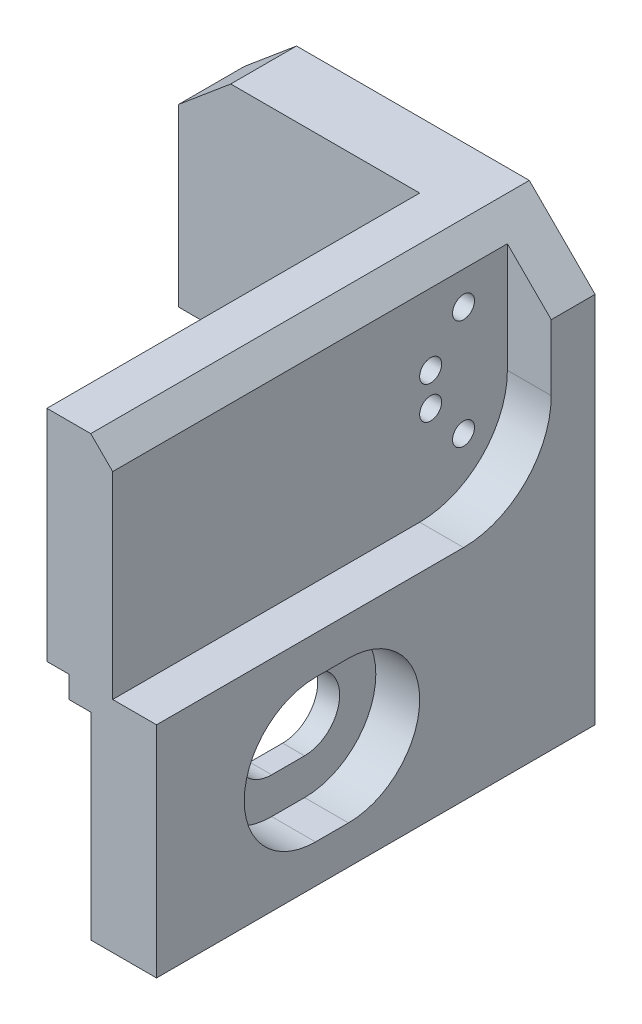
ISO-10303-21;
HEADER;
FILE_DESCRIPTION(('STEP AP214'),'2;1');
FILE_NAME('part.step','',(''),(''),'','','');
FILE_SCHEMA(('AUTOMOTIVE_DESIGN { 1 0 10303 214 1 1 1 1 }'));
ENDSEC;
DATA;
#1=APPLICATION_CONTEXT('core data for automotive mechanical design processes');
#2=APPLICATION_PROTOCOL_DEFINITION('international standard','automotive_design',2000,#1);
#3=PRODUCT_CONTEXT('',#1,'mechanical');
#4=PRODUCT('Part','Part','',(#3));
#5=PRODUCT_RELATED_PRODUCT_CATEGORY('part','',(#4));
#6=PRODUCT_DEFINITION_FORMATION('','',#4);
#7=PRODUCT_DEFINITION_CONTEXT('part definition',#1,'design');
#8=PRODUCT_DEFINITION('design','',#6,#7);
#9=PRODUCT_DEFINITION_SHAPE('','',#8);
#10=(LENGTH_UNIT() NAMED_UNIT(*) SI_UNIT(.MILLI.,.METRE.));
#11=(NAMED_UNIT(*) PLANE_ANGLE_UNIT() SI_UNIT($,.RADIAN.));
#12=(NAMED_UNIT(*) SI_UNIT($,.STERADIAN.) SOLID_ANGLE_UNIT());
#13=UNCERTAINTY_MEASURE_WITH_UNIT(LENGTH_MEASURE(1.E-05),#10,'distance_accuracy_value','');
#14=(GEOMETRIC_REPRESENTATION_CONTEXT(3) GLOBAL_UNCERTAINTY_ASSIGNED_CONTEXT((#13)) GLOBAL_UNIT_ASSIGNED_CONTEXT((#10,
#11,#12)) REPRESENTATION_CONTEXT('',''));
#15=CARTESIAN_POINT('',(0.,0.,0.));
#16=DIRECTION('',(0.,0.,1.));
#17=DIRECTION('',(1.,0.,0.));
#18=AXIS2_PLACEMENT_3D('',#15,#16,#17);
#19=CARTESIAN_POINT('',(-12.001,-5.6,-12.1414213562373));
#20=DIRECTION('',(0.,-1.,0.));
#21=DIRECTION('',(0.,0.,-1.));
#22=AXIS2_PLACEMENT_3D('',#19,#20,#21);
#23=PLANE('',#22);
#24=DIRECTION('',(0.,0.,-1.));
#25=VECTOR('',#24,1.);
#26=CARTESIAN_POINT('',(2.,-5.6,12.75));
#27=LINE('',#26,#25);
#28=CARTESIAN_POINT('',(2.,-5.6,12.75));
#29=VERTEX_POINT('',#28);
#30=CARTESIAN_POINT('',(2.,-5.6,11.25));
#31=VERTEX_POINT('',#30);
#32=EDGE_CURVE('E233',#29,#31,#27,.T.);
#33=ORIENTED_EDGE('',*,*,#32,.T.);
#34=DIRECTION('',(1.,0.,0.));
#35=VECTOR('',#34,1.);
#36=CARTESIAN_POINT('',(-12.001,-5.6,11.25));
#37=LINE('',#36,#35);
#38=CARTESIAN_POINT('',(1.,-5.6,11.25));
#39=VERTEX_POINT('',#38);
#40=EDGE_CURVE('E281',#39,#31,#37,.T.);
#41=ORIENTED_EDGE('',*,*,#40,.F.);
#42=DIRECTION('',(0.,0.,1.));
#43=VECTOR('',#42,1.);
#44=CARTESIAN_POINT('',(1.,-5.6,-12.1414213562373));
#45=LINE('',#44,#43);
#46=CARTESIAN_POINT('',(1.,-5.6,12.75));
#47=VERTEX_POINT('',#46);
#48=EDGE_CURVE('E278',#39,#47,#45,.T.);
#49=ORIENTED_EDGE('',*,*,#48,.T.);
#50=DIRECTION('',(1.,0.,0.));
#51=VECTOR('',#50,1.);
#52=CARTESIAN_POINT('',(-12.001,-5.6,12.75));
#53=LINE('',#52,#51);
#54=EDGE_CURVE('E282',#47,#29,#53,.T.);
#55=ORIENTED_EDGE('',*,*,#54,.T.);
#56=EDGE_LOOP('',(#33,#41,#49,#55));
#57=FACE_BOUND('',#56,.T.);
#58=ADVANCED_FACE('F39',(#57),#23,.F.);
#59=CARTESIAN_POINT('',(-12.001,-4.,12.75));
#60=DIRECTION('',(1.,0.,0.));
#61=DIRECTION('',(0.,0.,-1.));
#62=AXIS2_PLACEMENT_3D('',#59,#60,#61);
#63=CYLINDRICAL_SURFACE('',#62,1.6);
#64=CARTESIAN_POINT('',(2.,-4.,12.75));
#65=DIRECTION('',(1.,0.,0.));
#66=DIRECTION('',(0.,0.,-1.));
#67=AXIS2_PLACEMENT_3D('',#64,#65,#66);
#68=CIRCLE('',#67,1.6);
#69=CARTESIAN_POINT('',(2.,-2.4,12.75));
#70=VERTEX_POINT('',#69);
#71=EDGE_CURVE('E230',#70,#29,#68,.T.);
#72=ORIENTED_EDGE('',*,*,#71,.T.);
#73=ORIENTED_EDGE('',*,*,#54,.F.);
#74=CARTESIAN_POINT('',(1.,-4.,12.75));
#75=DIRECTION('',(1.,0.,0.));
#76=DIRECTION('',(0.,1.,0.));
#77=AXIS2_PLACEMENT_3D('',#74,#75,#76);
#78=CIRCLE('',#77,1.6);
#79=CARTESIAN_POINT('',(1.,-2.4,12.75));
#80=VERTEX_POINT('',#79);
#81=EDGE_CURVE('E275',#47,#80,#78,.F.);
#82=ORIENTED_EDGE('',*,*,#81,.T.);
#83=DIRECTION('',(1.,0.,0.));
#84=VECTOR('',#83,1.);
#85=CARTESIAN_POINT('',(-12.001,-2.4,12.75));
#86=LINE('',#85,#84);
#87=EDGE_CURVE('E286',#80,#70,#86,.T.);
#88=ORIENTED_EDGE('',*,*,#87,.T.);
#89=EDGE_LOOP('',(#72,#73,#82,#88));
#90=FACE_BOUND('',#89,.T.);
#91=ADVANCED_FACE('F485',(#90),#63,.F.);
#92=CARTESIAN_POINT('',(-12.001,-2.39999999999999,-12.1414213562373));
#93=DIRECTION('',(0.,-1.,0.));
#94=DIRECTION('',(0.,0.,-1.));
#95=AXIS2_PLACEMENT_3D('',#92,#93,#94);
#96=PLANE('',#95);
#97=DIRECTION('',(1.,0.,0.));
#98=VECTOR('',#97,1.);
#99=CARTESIAN_POINT('',(-12.001,-2.4,11.25));
#100=LINE('',#99,#98);
#101=CARTESIAN_POINT('',(1.,-2.4,11.25));
#102=VERTEX_POINT('',#101);
#103=CARTESIAN_POINT('',(2.,-2.4,11.25));
#104=VERTEX_POINT('',#103);
#105=EDGE_CURVE('E289',#102,#104,#100,.T.);
#106=ORIENTED_EDGE('',*,*,#105,.T.);
#107=DIRECTION('',(0.,0.,1.));
#108=VECTOR('',#107,1.);
#109=CARTESIAN_POINT('',(2.,-2.4,12.75));
#110=LINE('',#109,#108);
#111=EDGE_CURVE('E239',#104,#70,#110,.T.);
#112=ORIENTED_EDGE('',*,*,#111,.T.);
#113=ORIENTED_EDGE('',*,*,#87,.F.);
#114=DIRECTION('',(0.,0.,1.));
#115=VECTOR('',#114,1.);
#116=CARTESIAN_POINT('',(1.,-2.39999999999999,-12.1414213562373));
#117=LINE('',#116,#115);
#118=EDGE_CURVE('E267',#102,#80,#117,.T.);
#119=ORIENTED_EDGE('',*,*,#118,.F.);
#120=EDGE_LOOP('',(#106,#112,#113,#119));
#121=FACE_BOUND('',#120,.T.);
#122=ADVANCED_FACE('F491',(#121),#96,.T.);
#123=CARTESIAN_POINT('',(-12.001,-4.,11.25));
#124=DIRECTION('',(1.,0.,0.));
#125=DIRECTION('',(0.,0.,-1.));
#126=AXIS2_PLACEMENT_3D('',#123,#124,#125);
#127=CYLINDRICAL_SURFACE('',#126,1.6);
#128=CARTESIAN_POINT('',(2.,-4.,11.25));
#129=DIRECTION('',(1.,0.,0.));
#130=DIRECTION('',(0.,0.,-1.));
#131=AXIS2_PLACEMENT_3D('',#128,#129,#130);
#132=CIRCLE('',#131,1.6);
#133=EDGE_CURVE('E236',#31,#104,#132,.T.);
#134=ORIENTED_EDGE('',*,*,#133,.T.);
#135=ORIENTED_EDGE('',*,*,#105,.F.);
#136=CARTESIAN_POINT('',(1.,-4.,11.25));
#137=DIRECTION('',(1.,0.,0.));
#138=DIRECTION('',(0.,1.,0.));
#139=AXIS2_PLACEMENT_3D('',#136,#137,#138);
#140=CIRCLE('',#139,1.6);
#141=EDGE_CURVE('E285',#102,#39,#140,.F.);
#142=ORIENTED_EDGE('',*,*,#141,.T.);
#143=ORIENTED_EDGE('',*,*,#40,.T.);
#144=EDGE_LOOP('',(#134,#135,#142,#143));
#145=FACE_BOUND('',#144,.T.);
#146=ADVANCED_FACE('F496',(#145),#127,.F.);
#147=CARTESIAN_POINT('',(0.,1.,20.));
#148=DIRECTION('',(1.,0.,0.));
#149=DIRECTION('',(0.,1.,0.));
#150=AXIS2_PLACEMENT_3D('',#147,#148,#149);
#151=PLANE('',#150);
#152=DIRECTION('',(0.,-1.,0.));
#153=VECTOR('',#152,1.);
#154=CARTESIAN_POINT('',(0.,1.,0.));
#155=LINE('',#154,#153);
#156=CARTESIAN_POINT('',(0.,1.,0.));
#157=VERTEX_POINT('',#156);
#158=CARTESIAN_POINT('',(0.,0.,0.));
#159=VERTEX_POINT('',#158);
#160=EDGE_CURVE('E315',#157,#159,#155,.T.);
#161=ORIENTED_EDGE('',*,*,#160,.T.);
#162=DIRECTION('',(0.,0.,-1.));
#163=VECTOR('',#162,1.);
#164=CARTESIAN_POINT('',(0.,0.,20.));
#165=LINE('',#164,#163);
#166=CARTESIAN_POINT('',(0.,0.,20.));
#167=VERTEX_POINT('',#166);
#168=EDGE_CURVE('E363',#167,#159,#165,.T.);
#169=ORIENTED_EDGE('',*,*,#168,.F.);
#170=DIRECTION('',(0.,-1.,0.));
#171=VECTOR('',#170,1.);
#172=CARTESIAN_POINT('',(0.,1.,20.));
#173=LINE('',#172,#171);
#174=CARTESIAN_POINT('',(0.,1.,20.));
#175=VERTEX_POINT('',#174);
#176=EDGE_CURVE('E316',#175,#167,#173,.T.);
#177=ORIENTED_EDGE('',*,*,#176,.F.);
#178=DIRECTION('',(0.,0.,-1.));
#179=VECTOR('',#178,1.);
#180=CARTESIAN_POINT('',(0.,1.,20.));
#181=LINE('',#180,#179);
#182=EDGE_CURVE('E331',#175,#157,#181,.T.);
#183=ORIENTED_EDGE('',*,*,#182,.T.);
#184=EDGE_LOOP('',(#161,#169,#177,#183));
#185=FACE_BOUND('',#184,.T.);
#186=ADVANCED_FACE('F449',(#185),#151,.F.);
#187=CARTESIAN_POINT('',(0.,0.,20.));
#188=DIRECTION('',(0.,1.,0.));
#189=DIRECTION('',(0.,0.,1.));
#190=AXIS2_PLACEMENT_3D('',#187,#188,#189);
#191=PLANE('',#190);
#192=DIRECTION('',(1.,0.,0.));
#193=VECTOR('',#192,1.);
#194=CARTESIAN_POINT('',(0.,0.,0.));
#195=LINE('',#194,#193);
#196=CARTESIAN_POINT('',(1.,0.,0.));
#197=VERTEX_POINT('',#196);
#198=EDGE_CURVE('E334',#159,#197,#195,.T.);
#199=ORIENTED_EDGE('',*,*,#198,.T.);
#200=DIRECTION('',(0.,0.,-1.));
#201=VECTOR('',#200,1.);
#202=CARTESIAN_POINT('',(1.,0.,20.));
#203=LINE('',#202,#201);
#204=CARTESIAN_POINT('',(1.,0.,20.));
#205=VERTEX_POINT('',#204);
#206=EDGE_CURVE('E360',#205,#197,#203,.T.);
#207=ORIENTED_EDGE('',*,*,#206,.F.);
#208=DIRECTION('',(1.,0.,0.));
#209=VECTOR('',#208,1.);
#210=CARTESIAN_POINT('',(0.,0.,20.));
#211=LINE('',#210,#209);
#212=EDGE_CURVE('E319',#167,#205,#211,.T.);
#213=ORIENTED_EDGE('',*,*,#212,.F.);
#214=ORIENTED_EDGE('',*,*,#168,.T.);
#215=EDGE_LOOP('',(#199,#207,#213,#214));
#216=FACE_BOUND('',#215,.T.);
#217=ADVANCED_FACE('F454',(#216),#191,.F.);
#218=CARTESIAN_POINT('',(1.,0.,20.));
#219=DIRECTION('',(1.,0.,0.));
#220=DIRECTION('',(0.,1.,0.));
#221=AXIS2_PLACEMENT_3D('',#218,#219,#220);
#222=PLANE('',#221);
#223=ORIENTED_EDGE('',*,*,#81,.F.);
#224=ORIENTED_EDGE('',*,*,#48,.F.);
#225=ORIENTED_EDGE('',*,*,#141,.F.);
#226=ORIENTED_EDGE('',*,*,#118,.T.);
#227=EDGE_LOOP('',(#223,#224,#225,#226));
#228=FACE_BOUND('',#227,.T.);
#229=DIRECTION('',(0.,-1.,0.));
#230=VECTOR('',#229,1.);
#231=CARTESIAN_POINT('',(1.,0.,0.));
#232=LINE('',#231,#230);
#233=CARTESIAN_POINT('',(1.,-9.,0.));
#234=VERTEX_POINT('',#233);
#235=EDGE_CURVE('E336',#197,#234,#232,.T.);
#236=ORIENTED_EDGE('',*,*,#235,.T.);
#237=DIRECTION('',(0.,0.,-1.));
#238=VECTOR('',#237,1.);
#239=CARTESIAN_POINT('',(1.,-9.,20.));
#240=LINE('',#239,#238);
#241=CARTESIAN_POINT('',(1.,-9.,20.));
#242=VERTEX_POINT('',#241);
#243=EDGE_CURVE('E357',#242,#234,#240,.T.);
#244=ORIENTED_EDGE('',*,*,#243,.F.);
#245=DIRECTION('',(0.,-1.,0.));
#246=VECTOR('',#245,1.);
#247=CARTESIAN_POINT('',(1.,0.,20.));
#248=LINE('',#247,#246);
#249=EDGE_CURVE('E322',#205,#242,#248,.T.);
#250=ORIENTED_EDGE('',*,*,#249,.F.);
#251=ORIENTED_EDGE('',*,*,#206,.T.);
#252=EDGE_LOOP('',(#236,#244,#250,#251));
#253=FACE_BOUND('',#252,.T.);
#254=ADVANCED_FACE('F457',(#228,#253),#222,.F.);
#255=CARTESIAN_POINT('',(1.,-9.,20.));
#256=DIRECTION('',(0.,1.,0.));
#257=DIRECTION('',(0.,0.,1.));
#258=AXIS2_PLACEMENT_3D('',#255,#256,#257);
#259=PLANE('',#258);
#260=DIRECTION('',(1.,0.,0.));
#261=VECTOR('',#260,1.);
#262=CARTESIAN_POINT('',(1.,-9.,0.));
#263=LINE('',#262,#261);
#264=CARTESIAN_POINT('',(4.,-9.,0.));
#265=VERTEX_POINT('',#264);
#266=EDGE_CURVE('E338',#234,#265,#263,.T.);
#267=ORIENTED_EDGE('',*,*,#266,.T.);
#268=DIRECTION('',(0.,0.,-1.));
#269=VECTOR('',#268,1.);
#270=CARTESIAN_POINT('',(4.,-9.,20.));
#271=LINE('',#270,#269);
#272=CARTESIAN_POINT('',(4.,-9.,20.));
#273=VERTEX_POINT('',#272);
#274=EDGE_CURVE('E354',#273,#265,#271,.T.);
#275=ORIENTED_EDGE('',*,*,#274,.F.);
#276=DIRECTION('',(1.,0.,0.));
#277=VECTOR('',#276,1.);
#278=CARTESIAN_POINT('',(1.,-9.,20.));
#279=LINE('',#278,#277);
#280=EDGE_CURVE('E324',#242,#273,#279,.T.);
#281=ORIENTED_EDGE('',*,*,#280,.F.);
#282=ORIENTED_EDGE('',*,*,#243,.T.);
#283=EDGE_LOOP('',(#267,#275,#281,#282));
#284=FACE_BOUND('',#283,.T.);
#285=ADVANCED_FACE('F462',(#284),#259,.F.);
#286=CARTESIAN_POINT('',(4.,-9.,20.));
#287=DIRECTION('',(-1.,0.,0.));
#288=DIRECTION('',(0.,-1.,0.));
#289=AXIS2_PLACEMENT_3D('',#286,#287,#288);
#290=PLANE('',#289);
#291=DIRECTION('',(0.,0.,-1.));
#292=VECTOR('',#291,1.);
#293=CARTESIAN_POINT('',(4.,-7.25,12.75));
#294=LINE('',#293,#292);
#295=CARTESIAN_POINT('',(4.,-7.25,12.75));
#296=VERTEX_POINT('',#295);
#297=CARTESIAN_POINT('',(4.,-7.25,11.25));
#298=VERTEX_POINT('',#297);
#299=EDGE_CURVE('E257',#296,#298,#294,.T.);
#300=ORIENTED_EDGE('',*,*,#299,.F.);
#301=CARTESIAN_POINT('',(4.,-4.,12.75));
#302=DIRECTION('',(1.,0.,0.));
#303=DIRECTION('',(0.,0.,-1.));
#304=AXIS2_PLACEMENT_3D('',#301,#302,#303);
#305=CIRCLE('',#304,3.25);
#306=CARTESIAN_POINT('',(4.,-0.750000000000001,12.75));
#307=VERTEX_POINT('',#306);
#308=EDGE_CURVE('E63',#307,#296,#305,.T.);
#309=ORIENTED_EDGE('',*,*,#308,.F.);
#310=DIRECTION('',(0.,0.,1.));
#311=VECTOR('',#310,1.);
#312=CARTESIAN_POINT('',(4.,-0.750000000000001,12.75));
#313=LINE('',#312,#311);
#314=CARTESIAN_POINT('',(4.,-0.750000000000001,11.25));
#315=VERTEX_POINT('',#314);
#316=EDGE_CURVE('E246',#315,#307,#313,.T.);
#317=ORIENTED_EDGE('',*,*,#316,.F.);
#318=CARTESIAN_POINT('',(4.,-4.,11.25));
#319=DIRECTION('',(1.,0.,0.));
#320=DIRECTION('',(0.,0.,-1.));
#321=AXIS2_PLACEMENT_3D('',#318,#319,#320);
#322=CIRCLE('',#321,3.25);
#323=EDGE_CURVE('E260',#298,#315,#322,.T.);
#324=ORIENTED_EDGE('',*,*,#323,.F.);
#325=EDGE_LOOP('',(#300,#309,#317,#324));
#326=FACE_BOUND('',#325,.T.);
#327=DIRECTION('',(0.,0.,1.));
#328=VECTOR('',#327,1.);
#329=CARTESIAN_POINT('',(4.,7.99999999999999,20.));
#330=LINE('',#329,#328);
#331=CARTESIAN_POINT('',(4.,7.99999999999999,0.));
#332=VERTEX_POINT('',#331);
#333=CARTESIAN_POINT('',(4.,7.99999999999999,2.));
#334=VERTEX_POINT('',#333);
#335=EDGE_CURVE('E371',#332,#334,#330,.T.);
#336=ORIENTED_EDGE('',*,*,#335,.T.);
#337=DIRECTION('',(0.,1.,0.));
#338=VECTOR('',#337,1.);
#339=CARTESIAN_POINT('',(4.,1.00000000000001,2.));
#340=LINE('',#339,#338);
#341=CARTESIAN_POINT('',(4.,5.,2.));
#342=VERTEX_POINT('',#341);
#343=EDGE_CURVE('E209',#342,#334,#340,.T.);
#344=ORIENTED_EDGE('',*,*,#343,.F.);
#345=CARTESIAN_POINT('',(4.,5.,6.));
#346=DIRECTION('',(1.,0.,0.));
#347=DIRECTION('',(0.,1.,0.));
#348=AXIS2_PLACEMENT_3D('',#345,#346,#347);
#349=CIRCLE('',#348,4.);
#350=CARTESIAN_POINT('',(4.,1.,6.));
#351=VERTEX_POINT('',#350);
#352=EDGE_CURVE('E413',#342,#351,#349,.F.);
#353=ORIENTED_EDGE('',*,*,#352,.T.);
#354=DIRECTION('',(0.,0.,-1.));
#355=VECTOR('',#354,1.);
#356=CARTESIAN_POINT('',(4.,0.999999999999999,-12.1414213562373));
#357=LINE('',#356,#355);
#358=CARTESIAN_POINT('',(4.,1.,20.));
#359=VERTEX_POINT('',#358);
#360=EDGE_CURVE('E389',#359,#351,#357,.T.);
#361=ORIENTED_EDGE('',*,*,#360,.F.);
#362=DIRECTION('',(0.,1.,0.));
#363=VECTOR('',#362,1.);
#364=CARTESIAN_POINT('',(4.,-9.,20.));
#365=LINE('',#364,#363);
#366=EDGE_CURVE('E223',#273,#359,#365,.T.);
#367=ORIENTED_EDGE('',*,*,#366,.F.);
#368=ORIENTED_EDGE('',*,*,#274,.T.);
#369=DIRECTION('',(0.,1.,0.));
#370=VECTOR('',#369,1.);
#371=CARTESIAN_POINT('',(4.,-9.,0.));
#372=LINE('',#371,#370);
#373=EDGE_CURVE('E340',#265,#332,#372,.T.);
#374=ORIENTED_EDGE('',*,*,#373,.T.);
#375=EDGE_LOOP('',(#336,#344,#353,#361,#367,#368,#374));
#376=FACE_BOUND('',#375,.T.);
#377=ADVANCED_FACE('F424',(#326,#376),#290,.F.);
#378=CARTESIAN_POINT('',(4.,11.,20.));
#379=DIRECTION('',(0.,-1.,0.));
#380=DIRECTION('',(1.,0.,0.));
#381=AXIS2_PLACEMENT_3D('',#378,#379,#380);
#382=PLANE('',#381);
#383=DIRECTION('',(-1.,0.,0.));
#384=VECTOR('',#383,1.);
#385=CARTESIAN_POINT('',(4.,11.,0.));
#386=LINE('',#385,#384);
#387=CARTESIAN_POINT('',(1.,11.,0.));
#388=VERTEX_POINT('',#387);
#389=CARTESIAN_POINT('',(-9.61649281481157,11.,0.));
#390=VERTEX_POINT('',#389);
#391=EDGE_CURVE('E343',#388,#390,#386,.T.);
#392=ORIENTED_EDGE('',*,*,#391,.T.);
#393=DIRECTION('',(0.,0.,1.));
#394=VECTOR('',#393,1.);
#395=CARTESIAN_POINT('',(-9.61649281481157,11.,20.));
#396=LINE('',#395,#394);
#397=CARTESIAN_POINT('',(-9.61649281481155,11.,3.));
#398=VERTEX_POINT('',#397);
#399=EDGE_CURVE('E381',#390,#398,#396,.T.);
#400=ORIENTED_EDGE('',*,*,#399,.T.);
#401=DIRECTION('',(-1.,0.,0.));
#402=VECTOR('',#401,1.);
#403=CARTESIAN_POINT('',(20.723082923316,11.,3.));
#404=LINE('',#403,#402);
#405=CARTESIAN_POINT('',(-0.999999999999992,11.,3.));
#406=VERTEX_POINT('',#405);
#407=EDGE_CURVE('E305',#406,#398,#404,.T.);
#408=ORIENTED_EDGE('',*,*,#407,.F.);
#409=DIRECTION('',(0.,0.,-1.));
#410=VECTOR('',#409,1.);
#411=CARTESIAN_POINT('',(-0.99999999999999,11.,10.));
#412=LINE('',#411,#410);
#413=CARTESIAN_POINT('',(-0.999999999999992,11.,20.));
#414=VERTEX_POINT('',#413);
#415=EDGE_CURVE('E302',#414,#406,#412,.T.);
#416=ORIENTED_EDGE('',*,*,#415,.F.);
#417=DIRECTION('',(-1.,0.,0.));
#418=VECTOR('',#417,1.);
#419=CARTESIAN_POINT('',(4.,11.,20.));
#420=LINE('',#419,#418);
#421=CARTESIAN_POINT('',(1.,11.,20.));
#422=VERTEX_POINT('',#421);
#423=EDGE_CURVE('E327',#422,#414,#420,.T.);
#424=ORIENTED_EDGE('',*,*,#423,.F.);
#425=DIRECTION('',(0.,0.,-1.));
#426=VECTOR('',#425,1.);
#427=CARTESIAN_POINT('',(1.,11.,20.));
#428=LINE('',#427,#426);
#429=EDGE_CURVE('E366',#422,#388,#428,.T.);
#430=ORIENTED_EDGE('',*,*,#429,.T.);
#431=EDGE_LOOP('',(#392,#400,#408,#416,#424,#430));
#432=FACE_BOUND('',#431,.T.);
#433=ADVANCED_FACE('F434',(#432),#382,.F.);
#434=CARTESIAN_POINT('',(-12.,11.,20.));
#435=DIRECTION('',(1.,0.,0.));
#436=DIRECTION('',(0.,1.,0.));
#437=AXIS2_PLACEMENT_3D('',#434,#435,#436);
#438=PLANE('',#437);
#439=DIRECTION('',(0.,-1.,0.));
#440=VECTOR('',#439,1.);
#441=CARTESIAN_POINT('',(-12.,-11.5339484871634,3.));
#442=LINE('',#441,#440);
#443=CARTESIAN_POINT('',(-12.,8.99999999999998,3.));
#444=VERTEX_POINT('',#443);
#445=CARTESIAN_POINT('',(-12.,0.999999999999999,3.));
#446=VERTEX_POINT('',#445);
#447=EDGE_CURVE('E296',#444,#446,#442,.T.);
#448=ORIENTED_EDGE('',*,*,#447,.F.);
#449=DIRECTION('',(0.,0.,-1.));
#450=VECTOR('',#449,1.);
#451=CARTESIAN_POINT('',(-12.,8.99999999999999,20.));
#452=LINE('',#451,#450);
#453=CARTESIAN_POINT('',(-12.,8.99999999999999,0.));
#454=VERTEX_POINT('',#453);
#455=EDGE_CURVE('E376',#444,#454,#452,.T.);
#456=ORIENTED_EDGE('',*,*,#455,.T.);
#457=DIRECTION('',(0.,-1.,0.));
#458=VECTOR('',#457,1.);
#459=CARTESIAN_POINT('',(-12.,11.,0.));
#460=LINE('',#459,#458);
#461=CARTESIAN_POINT('',(-12.,0.999999999999999,0.));
#462=VERTEX_POINT('',#461);
#463=EDGE_CURVE('E346',#454,#462,#460,.T.);
#464=ORIENTED_EDGE('',*,*,#463,.T.);
#465=DIRECTION('',(0.,0.,-1.));
#466=VECTOR('',#465,1.);
#467=CARTESIAN_POINT('',(-12.,0.999999999999999,20.));
#468=LINE('',#467,#466);
#469=EDGE_CURVE('E351',#446,#462,#468,.T.);
#470=ORIENTED_EDGE('',*,*,#469,.F.);
#471=EDGE_LOOP('',(#448,#456,#464,#470));
#472=FACE_BOUND('',#471,.T.);
#473=ADVANCED_FACE('F475',(#472),#438,.F.);
#474=CARTESIAN_POINT('',(-12.,0.999999999999999,20.));
#475=DIRECTION('',(0.,1.,0.));
#476=DIRECTION('',(-1.,0.,0.));
#477=AXIS2_PLACEMENT_3D('',#474,#475,#476);
#478=PLANE('',#477);
#479=DIRECTION('',(1.,0.,0.));
#480=VECTOR('',#479,1.);
#481=CARTESIAN_POINT('',(-12.,0.999999999999999,20.));
#482=LINE('',#481,#480);
#483=CARTESIAN_POINT('',(-0.99999999999999,1.,20.));
#484=VERTEX_POINT('',#483);
#485=EDGE_CURVE('E329',#484,#175,#482,.T.);
#486=ORIENTED_EDGE('',*,*,#485,.F.);
#487=DIRECTION('',(0.,0.,1.));
#488=VECTOR('',#487,1.);
#489=CARTESIAN_POINT('',(-0.99999999999999,1.,10.));
#490=LINE('',#489,#488);
#491=CARTESIAN_POINT('',(-0.99999999999999,1.,3.));
#492=VERTEX_POINT('',#491);
#493=EDGE_CURVE('E309',#492,#484,#490,.T.);
#494=ORIENTED_EDGE('',*,*,#493,.F.);
#495=DIRECTION('',(-1.,0.,0.));
#496=VECTOR('',#495,1.);
#497=CARTESIAN_POINT('',(20.723082923316,1.00000000000001,3.));
#498=LINE('',#497,#496);
#499=EDGE_CURVE('E301',#492,#446,#498,.T.);
#500=ORIENTED_EDGE('',*,*,#499,.T.);
#501=ORIENTED_EDGE('',*,*,#469,.T.);
#502=DIRECTION('',(1.,0.,0.));
#503=VECTOR('',#502,1.);
#504=CARTESIAN_POINT('',(-12.,0.999999999999999,0.));
#505=LINE('',#504,#503);
#506=EDGE_CURVE('E320',#462,#157,#505,.T.);
#507=ORIENTED_EDGE('',*,*,#506,.T.);
#508=ORIENTED_EDGE('',*,*,#182,.F.);
#509=EDGE_LOOP('',(#486,#494,#500,#501,#507,#508));
#510=FACE_BOUND('',#509,.T.);
#511=ADVANCED_FACE('F443',(#510),#478,.F.);
#512=CARTESIAN_POINT('',(0.,0.,20.));
#513=DIRECTION('',(0.,0.,1.));
#514=DIRECTION('',(1.,0.,0.));
#515=AXIS2_PLACEMENT_3D('',#512,#513,#514);
#516=PLANE('',#515);
#517=DIRECTION('',(1.,0.,0.));
#518=VECTOR('',#517,1.);
#519=CARTESIAN_POINT('',(2.,1.,20.));
#520=LINE('',#519,#518);
#521=CARTESIAN_POINT('',(2.,1.,20.));
#522=VERTEX_POINT('',#521);
#523=EDGE_CURVE('E215',#522,#359,#520,.T.);
#524=ORIENTED_EDGE('',*,*,#523,.F.);
#525=DIRECTION('',(0.,-1.,0.));
#526=VECTOR('',#525,1.);
#527=CARTESIAN_POINT('',(2.,1.00000000000001,20.));
#528=LINE('',#527,#526);
#529=CARTESIAN_POINT('',(2.,10.,20.));
#530=VERTEX_POINT('',#529);
#531=EDGE_CURVE('E201',#530,#522,#528,.T.);
#532=ORIENTED_EDGE('',*,*,#531,.F.);
#533=DIRECTION('',(0.707106781186546,-0.707106781186549,0.));
#534=VECTOR('',#533,1.);
#535=CARTESIAN_POINT('',(6.00000000000001,5.99999999999998,20.));
#536=LINE('',#535,#534);
#537=EDGE_CURVE('E374',#530,#422,#536,.F.);
#538=ORIENTED_EDGE('',*,*,#537,.T.);
#539=ORIENTED_EDGE('',*,*,#423,.T.);
#540=DIRECTION('',(0.,1.,0.));
#541=VECTOR('',#540,1.);
#542=CARTESIAN_POINT('',(-0.99999999999999,-11.5339484871634,20.));
#543=LINE('',#542,#541);
#544=EDGE_CURVE('E306',#484,#414,#543,.T.);
#545=ORIENTED_EDGE('',*,*,#544,.F.);
#546=ORIENTED_EDGE('',*,*,#485,.T.);
#547=ORIENTED_EDGE('',*,*,#176,.T.);
#548=ORIENTED_EDGE('',*,*,#212,.T.);
#549=ORIENTED_EDGE('',*,*,#249,.T.);
#550=ORIENTED_EDGE('',*,*,#280,.T.);
#551=ORIENTED_EDGE('',*,*,#366,.T.);
#552=EDGE_LOOP('',(#524,#532,#538,#539,#545,#546,#547,#548,#549,#550,#551));
#553=FACE_BOUND('',#552,.T.);
#554=ADVANCED_FACE('F221',(#553),#516,.T.);
#555=CARTESIAN_POINT('',(0.,0.,0.));
#556=DIRECTION('',(0.,0.,1.));
#557=DIRECTION('',(1.,0.,0.));
#558=AXIS2_PLACEMENT_3D('',#555,#556,#557);
#559=PLANE('',#558);
#560=ORIENTED_EDGE('',*,*,#463,.F.);
#561=DIRECTION('',(-0.766044443118977,-0.642787609686541,0.));
#562=VECTOR('',#561,1.);
#563=CARTESIAN_POINT('',(-12.,8.99999999999999,0.));
#564=LINE('',#563,#562);
#565=EDGE_CURVE('E379',#454,#390,#564,.F.);
#566=ORIENTED_EDGE('',*,*,#565,.T.);
#567=ORIENTED_EDGE('',*,*,#391,.F.);
#568=DIRECTION('',(-0.707106781186546,0.707106781186549,0.));
#569=VECTOR('',#568,1.);
#570=CARTESIAN_POINT('',(1.,11.,0.));
#571=LINE('',#570,#569);
#572=EDGE_CURVE('E369',#388,#332,#571,.F.);
#573=ORIENTED_EDGE('',*,*,#572,.T.);
#574=ORIENTED_EDGE('',*,*,#373,.F.);
#575=ORIENTED_EDGE('',*,*,#266,.F.);
#576=ORIENTED_EDGE('',*,*,#235,.F.);
#577=ORIENTED_EDGE('',*,*,#198,.F.);
#578=ORIENTED_EDGE('',*,*,#160,.F.);
#579=ORIENTED_EDGE('',*,*,#506,.F.);
#580=EDGE_LOOP('',(#560,#566,#567,#573,#574,#575,#576,#577,#578,#579));
#581=FACE_BOUND('',#580,.T.);
#582=ADVANCED_FACE('F465',(#581),#559,.F.);
#583=CARTESIAN_POINT('',(-0.999999999999992,0.,20.));
#584=DIRECTION('',(1.,0.,0.));
#585=DIRECTION('',(0.,1.,0.));
#586=AXIS2_PLACEMENT_3D('',#583,#584,#585);
#587=PLANE('',#586);
#588=CARTESIAN_POINT('',(-0.999999999999992,3.5,4.));
#589=DIRECTION('',(-1.,0.,0.));
#590=DIRECTION('',(0.,-1.,0.));
#591=AXIS2_PLACEMENT_3D('',#588,#589,#590);
#592=CIRCLE('',#591,0.500000000000001);
#593=CARTESIAN_POINT('',(-0.999999999999992,3.,4.));
#594=VERTEX_POINT('',#593);
#595=EDGE_CURVE('E406',#594,#594,#592,.T.);
#596=ORIENTED_EDGE('',*,*,#595,.F.);
#597=EDGE_LOOP('',(#596));
#598=FACE_BOUND('',#597,.T.);
#599=CARTESIAN_POINT('',(-0.999999999999992,5.25,5.5));
#600=DIRECTION('',(-1.,0.,0.));
#601=DIRECTION('',(0.,-1.,0.));
#602=AXIS2_PLACEMENT_3D('',#599,#600,#601);
#603=CIRCLE('',#602,0.500000000000001);
#604=CARTESIAN_POINT('',(-0.999999999999992,4.75,5.5));
#605=VERTEX_POINT('',#604);
#606=EDGE_CURVE('E396',#605,#605,#603,.T.);
#607=ORIENTED_EDGE('',*,*,#606,.F.);
#608=EDGE_LOOP('',(#607));
#609=FACE_BOUND('',#608,.T.);
#610=CARTESIAN_POINT('',(-0.999999999999992,6.75,5.5));
#611=DIRECTION('',(-1.,0.,0.));
#612=DIRECTION('',(0.,-1.,0.));
#613=AXIS2_PLACEMENT_3D('',#610,#611,#612);
#614=CIRCLE('',#613,0.500000000000001);
#615=CARTESIAN_POINT('',(-0.999999999999992,6.25,5.5));
#616=VERTEX_POINT('',#615);
#617=EDGE_CURVE('E393',#616,#616,#614,.T.);
#618=ORIENTED_EDGE('',*,*,#617,.F.);
#619=EDGE_LOOP('',(#618));
#620=FACE_BOUND('',#619,.T.);
#621=CARTESIAN_POINT('',(-0.999999999999992,8.5,4.));
#622=DIRECTION('',(-1.,0.,0.));
#623=DIRECTION('',(0.,-1.,0.));
#624=AXIS2_PLACEMENT_3D('',#621,#622,#623);
#625=CIRCLE('',#624,0.500000000000001);
#626=CARTESIAN_POINT('',(-0.999999999999992,8.,4.));
#627=VERTEX_POINT('',#626);
#628=EDGE_CURVE('E390',#627,#627,#625,.T.);
#629=ORIENTED_EDGE('',*,*,#628,.F.);
#630=EDGE_LOOP('',(#629));
#631=FACE_BOUND('',#630,.T.);
#632=ORIENTED_EDGE('',*,*,#415,.T.);
#633=DIRECTION('',(0.,-1.,0.));
#634=VECTOR('',#633,1.);
#635=CARTESIAN_POINT('',(-0.99999999999999,-11.5339484871634,3.));
#636=LINE('',#635,#634);
#637=EDGE_CURVE('E298',#406,#492,#636,.T.);
#638=ORIENTED_EDGE('',*,*,#637,.T.);
#639=ORIENTED_EDGE('',*,*,#493,.T.);
#640=ORIENTED_EDGE('',*,*,#544,.T.);
#641=EDGE_LOOP('',(#632,#638,#639,#640));
#642=FACE_BOUND('',#641,.T.);
#643=ADVANCED_FACE('F438',(#598,#609,#620,#631,#642),#587,.F.);
#644=CARTESIAN_POINT('',(20.723082923316,-11.5339484871634,3.));
#645=DIRECTION('',(0.,0.,-1.));
#646=DIRECTION('',(-1.,0.,0.));
#647=AXIS2_PLACEMENT_3D('',#644,#645,#646);
#648=PLANE('',#647);
#649=ORIENTED_EDGE('',*,*,#407,.T.);
#650=DIRECTION('',(0.766044443118977,0.642787609686541,0.));
#651=VECTOR('',#650,1.);
#652=CARTESIAN_POINT('',(-12.,8.99999999999999,3.));
#653=LINE('',#652,#651);
#654=EDGE_CURVE('E383',#398,#444,#653,.F.);
#655=ORIENTED_EDGE('',*,*,#654,.T.);
#656=ORIENTED_EDGE('',*,*,#447,.T.);
#657=ORIENTED_EDGE('',*,*,#499,.F.);
#658=ORIENTED_EDGE('',*,*,#637,.F.);
#659=EDGE_LOOP('',(#649,#655,#656,#657,#658));
#660=FACE_BOUND('',#659,.T.);
#661=ADVANCED_FACE('F472',(#660),#648,.F.);
#662=CARTESIAN_POINT('',(1.,11.,20.));
#663=DIRECTION('',(-0.707106781186549,-0.707106781186546,0.));
#664=DIRECTION('',(0.707106781186546,-0.707106781186549,0.));
#665=AXIS2_PLACEMENT_3D('',#662,#663,#664);
#666=PLANE('',#665);
#667=DIRECTION('',(0.707106781186546,-0.707106781186549,0.));
#668=VECTOR('',#667,1.);
#669=CARTESIAN_POINT('',(1.,11.,2.));
#670=LINE('',#669,#668);
#671=CARTESIAN_POINT('',(2.,10.,2.));
#672=VERTEX_POINT('',#671);
#673=EDGE_CURVE('E13',#334,#672,#670,.F.);
#674=ORIENTED_EDGE('',*,*,#673,.F.);
#675=ORIENTED_EDGE('',*,*,#335,.F.);
#676=ORIENTED_EDGE('',*,*,#572,.F.);
#677=ORIENTED_EDGE('',*,*,#429,.F.);
#678=ORIENTED_EDGE('',*,*,#537,.F.);
#679=DIRECTION('',(0.,0.,1.));
#680=VECTOR('',#679,1.);
#681=CARTESIAN_POINT('',(2.,10.,20.));
#682=LINE('',#681,#680);
#683=EDGE_CURVE('E48',#530,#672,#682,.F.);
#684=ORIENTED_EDGE('',*,*,#683,.T.);
#685=EDGE_LOOP('',(#674,#675,#676,#677,#678,#684));
#686=FACE_BOUND('',#685,.T.);
#687=ADVANCED_FACE('F428',(#686),#666,.F.);
#688=CARTESIAN_POINT('',(-12.,8.99999999999999,20.));
#689=DIRECTION('',(0.642787609686541,-0.766044443118977,0.));
#690=DIRECTION('',(0.766044443118977,0.642787609686541,0.));
#691=AXIS2_PLACEMENT_3D('',#688,#689,#690);
#692=PLANE('',#691);
#693=ORIENTED_EDGE('',*,*,#654,.F.);
#694=ORIENTED_EDGE('',*,*,#399,.F.);
#695=ORIENTED_EDGE('',*,*,#565,.F.);
#696=ORIENTED_EDGE('',*,*,#455,.F.);
#697=EDGE_LOOP('',(#693,#694,#695,#696));
#698=FACE_BOUND('',#697,.T.);
#699=ADVANCED_FACE('F41',(#698),#692,.F.);
#700=CARTESIAN_POINT('',(2.,-4.,12.75));
#701=DIRECTION('',(1.,0.,0.));
#702=DIRECTION('',(0.,0.,-1.));
#703=AXIS2_PLACEMENT_3D('',#700,#701,#702);
#704=CYLINDRICAL_SURFACE('',#703,3.25);
#705=ORIENTED_EDGE('',*,*,#308,.T.);
#706=DIRECTION('',(1.,0.,0.));
#707=VECTOR('',#706,1.);
#708=CARTESIAN_POINT('',(2.,-7.25,12.75));
#709=LINE('',#708,#707);
#710=CARTESIAN_POINT('',(2.,-7.25,12.75));
#711=VERTEX_POINT('',#710);
#712=EDGE_CURVE('E255',#711,#296,#709,.T.);
#713=ORIENTED_EDGE('',*,*,#712,.F.);
#714=CARTESIAN_POINT('',(2.,-4.,12.75));
#715=DIRECTION('',(1.,0.,0.));
#716=DIRECTION('',(0.,0.,-1.));
#717=AXIS2_PLACEMENT_3D('',#714,#715,#716);
#718=CIRCLE('',#717,3.25);
#719=CARTESIAN_POINT('',(2.,-0.750000000000001,12.75));
#720=VERTEX_POINT('',#719);
#721=EDGE_CURVE('E242',#720,#711,#718,.T.);
#722=ORIENTED_EDGE('',*,*,#721,.F.);
#723=DIRECTION('',(1.,0.,0.));
#724=VECTOR('',#723,1.);
#725=CARTESIAN_POINT('',(2.,-0.750000000000001,12.75));
#726=LINE('',#725,#724);
#727=EDGE_CURVE('E265',#720,#307,#726,.T.);
#728=ORIENTED_EDGE('',*,*,#727,.T.);
#729=EDGE_LOOP('',(#705,#713,#722,#728));
#730=FACE_BOUND('',#729,.T.);
#731=ADVANCED_FACE('F532',(#730),#704,.F.);
#732=CARTESIAN_POINT('',(2.,-0.750000000000001,12.75));
#733=DIRECTION('',(0.,1.,0.));
#734=DIRECTION('',(0.,0.,1.));
#735=AXIS2_PLACEMENT_3D('',#732,#733,#734);
#736=PLANE('',#735);
#737=ORIENTED_EDGE('',*,*,#316,.T.);
#738=ORIENTED_EDGE('',*,*,#727,.F.);
#739=DIRECTION('',(0.,0.,1.));
#740=VECTOR('',#739,1.);
#741=CARTESIAN_POINT('',(2.,-0.750000000000001,12.75));
#742=LINE('',#741,#740);
#743=CARTESIAN_POINT('',(2.,-0.750000000000001,11.25));
#744=VERTEX_POINT('',#743);
#745=EDGE_CURVE('E252',#744,#720,#742,.T.);
#746=ORIENTED_EDGE('',*,*,#745,.F.);
#747=DIRECTION('',(1.,0.,0.));
#748=VECTOR('',#747,1.);
#749=CARTESIAN_POINT('',(2.,-0.750000000000001,11.25));
#750=LINE('',#749,#748);
#751=EDGE_CURVE('E268',#744,#315,#750,.T.);
#752=ORIENTED_EDGE('',*,*,#751,.T.);
#753=EDGE_LOOP('',(#737,#738,#746,#752));
#754=FACE_BOUND('',#753,.T.);
#755=ADVANCED_FACE('F538',(#754),#736,.F.);
#756=CARTESIAN_POINT('',(2.,-4.,11.25));
#757=DIRECTION('',(1.,0.,0.));
#758=DIRECTION('',(0.,0.,-1.));
#759=AXIS2_PLACEMENT_3D('',#756,#757,#758);
#760=CYLINDRICAL_SURFACE('',#759,3.25);
#761=ORIENTED_EDGE('',*,*,#323,.T.);
#762=ORIENTED_EDGE('',*,*,#751,.F.);
#763=CARTESIAN_POINT('',(2.,-4.,11.25));
#764=DIRECTION('',(1.,0.,0.));
#765=DIRECTION('',(0.,0.,-1.));
#766=AXIS2_PLACEMENT_3D('',#763,#764,#765);
#767=CIRCLE('',#766,3.25);
#768=CARTESIAN_POINT('',(2.,-7.25,11.25));
#769=VERTEX_POINT('',#768);
#770=EDGE_CURVE('E249',#769,#744,#767,.T.);
#771=ORIENTED_EDGE('',*,*,#770,.F.);
#772=DIRECTION('',(1.,0.,0.));
#773=VECTOR('',#772,1.);
#774=CARTESIAN_POINT('',(2.,-7.25,11.25));
#775=LINE('',#774,#773);
#776=EDGE_CURVE('E270',#769,#298,#775,.T.);
#777=ORIENTED_EDGE('',*,*,#776,.T.);
#778=EDGE_LOOP('',(#761,#762,#771,#777));
#779=FACE_BOUND('',#778,.T.);
#780=ADVANCED_FACE('F546',(#779),#760,.F.);
#781=CARTESIAN_POINT('',(2.,-7.25,12.75));
#782=DIRECTION('',(0.,-1.,0.));
#783=DIRECTION('',(0.,0.,-1.));
#784=AXIS2_PLACEMENT_3D('',#781,#782,#783);
#785=PLANE('',#784);
#786=ORIENTED_EDGE('',*,*,#299,.T.);
#787=ORIENTED_EDGE('',*,*,#776,.F.);
#788=DIRECTION('',(0.,0.,-1.));
#789=VECTOR('',#788,1.);
#790=CARTESIAN_POINT('',(2.,-7.25,12.75));
#791=LINE('',#790,#789);
#792=EDGE_CURVE('E245',#711,#769,#791,.T.);
#793=ORIENTED_EDGE('',*,*,#792,.F.);
#794=ORIENTED_EDGE('',*,*,#712,.T.);
#795=EDGE_LOOP('',(#786,#787,#793,#794));
#796=FACE_BOUND('',#795,.T.);
#797=ADVANCED_FACE('F554',(#796),#785,.F.);
#798=CARTESIAN_POINT('',(2.,-4.,12.75));
#799=DIRECTION('',(1.,0.,0.));
#800=DIRECTION('',(0.,0.,-1.));
#801=AXIS2_PLACEMENT_3D('',#798,#799,#800);
#802=PLANE('',#801);
#803=ORIENTED_EDGE('',*,*,#111,.F.);
#804=ORIENTED_EDGE('',*,*,#133,.F.);
#805=ORIENTED_EDGE('',*,*,#32,.F.);
#806=ORIENTED_EDGE('',*,*,#71,.F.);
#807=EDGE_LOOP('',(#803,#804,#805,#806));
#808=FACE_BOUND('',#807,.T.);
#809=ORIENTED_EDGE('',*,*,#721,.T.);
#810=ORIENTED_EDGE('',*,*,#792,.T.);
#811=ORIENTED_EDGE('',*,*,#770,.T.);
#812=ORIENTED_EDGE('',*,*,#745,.T.);
#813=EDGE_LOOP('',(#809,#810,#811,#812));
#814=FACE_BOUND('',#813,.T.);
#815=ADVANCED_FACE('F562',(#808,#814),#802,.T.);
#816=CARTESIAN_POINT('',(2.,1.00000000000001,2.));
#817=DIRECTION('',(0.,0.,-1.));
#818=DIRECTION('',(0.,1.,0.));
#819=AXIS2_PLACEMENT_3D('',#816,#817,#818);
#820=PLANE('',#819);
#821=ORIENTED_EDGE('',*,*,#673,.T.);
#822=DIRECTION('',(0.,1.,0.));
#823=VECTOR('',#822,1.);
#824=CARTESIAN_POINT('',(2.,1.00000000000001,2.));
#825=LINE('',#824,#823);
#826=CARTESIAN_POINT('',(2.,5.,2.));
#827=VERTEX_POINT('',#826);
#828=EDGE_CURVE('E56',#827,#672,#825,.T.);
#829=ORIENTED_EDGE('',*,*,#828,.F.);
#830=DIRECTION('',(1.,0.,0.));
#831=VECTOR('',#830,1.);
#832=CARTESIAN_POINT('',(2.,5.,2.));
#833=LINE('',#832,#831);
#834=EDGE_CURVE('E225',#827,#342,#833,.T.);
#835=ORIENTED_EDGE('',*,*,#834,.T.);
#836=ORIENTED_EDGE('',*,*,#343,.T.);
#837=EDGE_LOOP('',(#821,#829,#835,#836));
#838=FACE_BOUND('',#837,.T.);
#839=ADVANCED_FACE('F418',(#838),#820,.F.);
#840=CARTESIAN_POINT('',(2.,5.,6.));
#841=DIRECTION('',(1.,0.,0.));
#842=DIRECTION('',(0.,1.,0.));
#843=AXIS2_PLACEMENT_3D('',#840,#841,#842);
#844=CYLINDRICAL_SURFACE('',#843,4.);
#845=ORIENTED_EDGE('',*,*,#352,.F.);
#846=ORIENTED_EDGE('',*,*,#834,.F.);
#847=CARTESIAN_POINT('',(2.,5.,6.));
#848=DIRECTION('',(1.,0.,0.));
#849=DIRECTION('',(0.,1.,0.));
#850=AXIS2_PLACEMENT_3D('',#847,#848,#849);
#851=CIRCLE('',#850,4.);
#852=CARTESIAN_POINT('',(2.,1.,6.));
#853=VERTEX_POINT('',#852);
#854=EDGE_CURVE('E218',#827,#853,#851,.F.);
#855=ORIENTED_EDGE('',*,*,#854,.T.);
#856=DIRECTION('',(1.,0.,0.));
#857=VECTOR('',#856,1.);
#858=CARTESIAN_POINT('',(2.,1.,6.));
#859=LINE('',#858,#857);
#860=EDGE_CURVE('E217',#853,#351,#859,.T.);
#861=ORIENTED_EDGE('',*,*,#860,.T.);
#862=EDGE_LOOP('',(#845,#846,#855,#861));
#863=FACE_BOUND('',#862,.T.);
#864=ADVANCED_FACE('F422',(#863),#844,.F.);
#865=CARTESIAN_POINT('',(2.,0.999999999999999,-12.1414213562373));
#866=DIRECTION('',(0.,-1.,0.));
#867=DIRECTION('',(0.,0.,-1.));
#868=AXIS2_PLACEMENT_3D('',#865,#866,#867);
#869=PLANE('',#868);
#870=ORIENTED_EDGE('',*,*,#360,.T.);
#871=ORIENTED_EDGE('',*,*,#860,.F.);
#872=DIRECTION('',(0.,0.,-1.));
#873=VECTOR('',#872,1.);
#874=CARTESIAN_POINT('',(2.,0.999999999999999,-12.1414213562373));
#875=LINE('',#874,#873);
#876=EDGE_CURVE('E204',#522,#853,#875,.T.);
#877=ORIENTED_EDGE('',*,*,#876,.F.);
#878=ORIENTED_EDGE('',*,*,#523,.T.);
#879=EDGE_LOOP('',(#870,#871,#877,#878));
#880=FACE_BOUND('',#879,.T.);
#881=ADVANCED_FACE('F214',(#880),#869,.F.);
#882=CARTESIAN_POINT('',(2.,1.00000000000001,-12.1414213562373));
#883=DIRECTION('',(1.,0.,0.));
#884=DIRECTION('',(0.,1.,0.));
#885=AXIS2_PLACEMENT_3D('',#882,#883,#884);
#886=PLANE('',#885);
#887=CARTESIAN_POINT('',(2.,3.5,4.));
#888=DIRECTION('',(1.,0.,0.));
#889=DIRECTION('',(0.,1.,0.));
#890=AXIS2_PLACEMENT_3D('',#887,#888,#889);
#891=CIRCLE('',#890,0.500000000000001);
#892=CARTESIAN_POINT('',(2.,4.,4.));
#893=VERTEX_POINT('',#892);
#894=EDGE_CURVE('E43',#893,#893,#891,.T.);
#895=ORIENTED_EDGE('',*,*,#894,.F.);
#896=EDGE_LOOP('',(#895));
#897=FACE_BOUND('',#896,.T.);
#898=CARTESIAN_POINT('',(2.,5.25,5.5));
#899=DIRECTION('',(1.,0.,0.));
#900=DIRECTION('',(0.,1.,0.));
#901=AXIS2_PLACEMENT_3D('',#898,#899,#900);
#902=CIRCLE('',#901,0.500000000000001);
#903=CARTESIAN_POINT('',(2.,5.75,5.5));
#904=VERTEX_POINT('',#903);
#905=EDGE_CURVE('E394',#904,#904,#902,.T.);
#906=ORIENTED_EDGE('',*,*,#905,.F.);
#907=EDGE_LOOP('',(#906));
#908=FACE_BOUND('',#907,.T.);
#909=CARTESIAN_POINT('',(2.,6.75,5.5));
#910=DIRECTION('',(1.,0.,0.));
#911=DIRECTION('',(0.,1.,0.));
#912=AXIS2_PLACEMENT_3D('',#909,#910,#911);
#913=CIRCLE('',#912,0.500000000000001);
#914=CARTESIAN_POINT('',(2.,7.25,5.5));
#915=VERTEX_POINT('',#914);
#916=EDGE_CURVE('E391',#915,#915,#913,.T.);
#917=ORIENTED_EDGE('',*,*,#916,.F.);
#918=EDGE_LOOP('',(#917));
#919=FACE_BOUND('',#918,.T.);
#920=CARTESIAN_POINT('',(2.,8.5,4.));
#921=DIRECTION('',(1.,0.,0.));
#922=DIRECTION('',(0.,1.,0.));
#923=AXIS2_PLACEMENT_3D('',#920,#921,#922);
#924=CIRCLE('',#923,0.500000000000001);
#925=CARTESIAN_POINT('',(2.,9.,4.));
#926=VERTEX_POINT('',#925);
#927=EDGE_CURVE('E386',#926,#926,#924,.T.);
#928=ORIENTED_EDGE('',*,*,#927,.F.);
#929=EDGE_LOOP('',(#928));
#930=FACE_BOUND('',#929,.T.);
#931=ORIENTED_EDGE('',*,*,#531,.T.);
#932=ORIENTED_EDGE('',*,*,#876,.T.);
#933=ORIENTED_EDGE('',*,*,#854,.F.);
#934=ORIENTED_EDGE('',*,*,#828,.T.);
#935=ORIENTED_EDGE('',*,*,#683,.F.);
#936=EDGE_LOOP('',(#931,#932,#933,#934,#935));
#937=FACE_BOUND('',#936,.T.);
#938=ADVANCED_FACE('F203',(#897,#908,#919,#930,#937),#886,.T.);
#939=CARTESIAN_POINT('',(4.,8.5,4.));
#940=DIRECTION('',(-1.,0.,0.));
#941=DIRECTION('',(0.,-1.,0.));
#942=AXIS2_PLACEMENT_3D('',#939,#940,#941);
#943=CYLINDRICAL_SURFACE('',#942,0.500000000000001);
#944=ORIENTED_EDGE('',*,*,#927,.T.);
#945=EDGE_LOOP('',(#944));
#946=FACE_BOUND('',#945,.T.);
#947=ORIENTED_EDGE('',*,*,#628,.T.);
#948=EDGE_LOOP('',(#947));
#949=FACE_BOUND('',#948,.T.);
#950=ADVANCED_FACE('F593',(#946,#949),#943,.F.);
#951=CARTESIAN_POINT('',(4.,6.75,5.5));
#952=DIRECTION('',(-1.,0.,0.));
#953=DIRECTION('',(0.,-1.,0.));
#954=AXIS2_PLACEMENT_3D('',#951,#952,#953);
#955=CYLINDRICAL_SURFACE('',#954,0.500000000000001);
#956=ORIENTED_EDGE('',*,*,#916,.T.);
#957=EDGE_LOOP('',(#956));
#958=FACE_BOUND('',#957,.T.);
#959=ORIENTED_EDGE('',*,*,#617,.T.);
#960=EDGE_LOOP('',(#959));
#961=FACE_BOUND('',#960,.T.);
#962=ADVANCED_FACE('F601',(#958,#961),#955,.F.);
#963=CARTESIAN_POINT('',(4.,5.25,5.5));
#964=DIRECTION('',(-1.,0.,0.));
#965=DIRECTION('',(0.,-1.,0.));
#966=AXIS2_PLACEMENT_3D('',#963,#964,#965);
#967=CYLINDRICAL_SURFACE('',#966,0.500000000000001);
#968=ORIENTED_EDGE('',*,*,#905,.T.);
#969=EDGE_LOOP('',(#968));
#970=FACE_BOUND('',#969,.T.);
#971=ORIENTED_EDGE('',*,*,#606,.T.);
#972=EDGE_LOOP('',(#971));
#973=FACE_BOUND('',#972,.T.);
#974=ADVANCED_FACE('F609',(#970,#973),#967,.F.);
#975=CARTESIAN_POINT('',(4.,3.5,4.));
#976=DIRECTION('',(-1.,0.,0.));
#977=DIRECTION('',(0.,-1.,0.));
#978=AXIS2_PLACEMENT_3D('',#975,#976,#977);
#979=CYLINDRICAL_SURFACE('',#978,0.500000000000001);
#980=ORIENTED_EDGE('',*,*,#894,.T.);
#981=EDGE_LOOP('',(#980));
#982=FACE_BOUND('',#981,.T.);
#983=ORIENTED_EDGE('',*,*,#595,.T.);
#984=EDGE_LOOP('',(#983));
#985=FACE_BOUND('',#984,.T.);
#986=ADVANCED_FACE('F617',(#982,#985),#979,.F.);
#987=CLOSED_SHELL('',(#58,#91,#122,#146,#186,#217,#254,#285,#377,#433,#473,#511,#554,#582,#643,
#661,#687,#699,#731,#755,#780,#797,#815,#839,#864,#881,#938,#950,#962,#974,#986));
#988=MANIFOLD_SOLID_BREP('B2',#987);
#989=ADVANCED_BREP_SHAPE_REPRESENTATION('',(#18,#988),#14);
#990=SHAPE_DEFINITION_REPRESENTATION(#9,#989);
ENDSEC;
END-ISO-10303-21;
